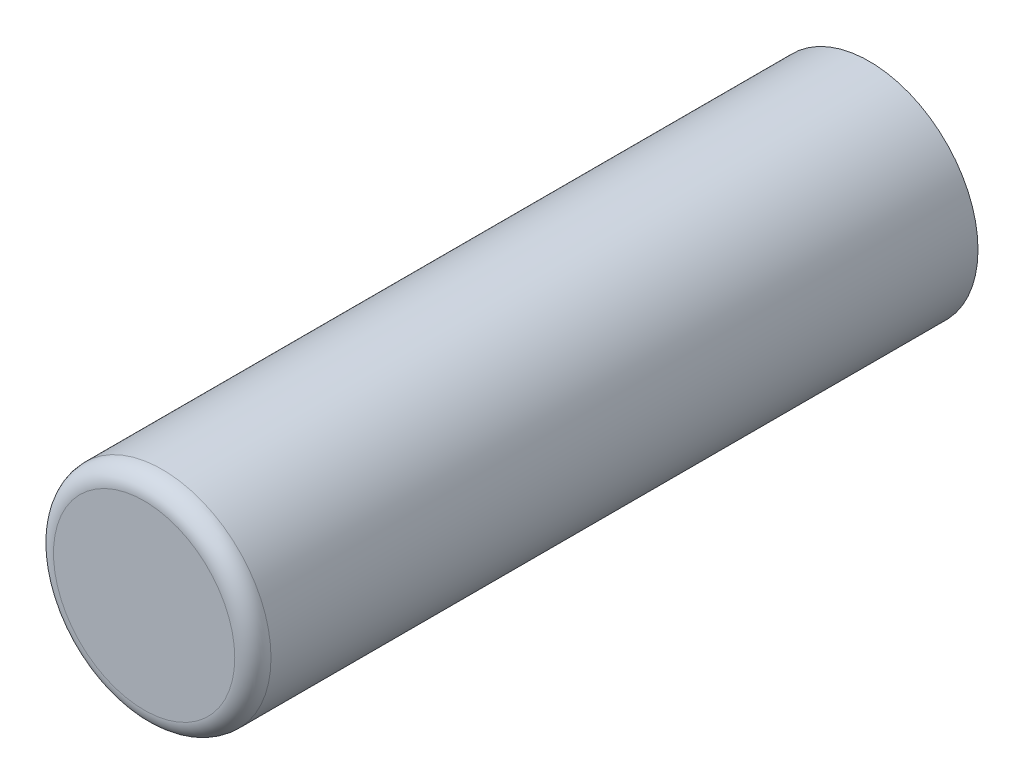
ISO-10303-21;
HEADER;
FILE_DESCRIPTION(('STEP AP214'),'2;1');
FILE_NAME('part.step','',(''),(''),'','','');
FILE_SCHEMA(('AUTOMOTIVE_DESIGN { 1 0 10303 214 1 1 1 1 }'));
ENDSEC;
DATA;
#1=APPLICATION_CONTEXT('core data for automotive mechanical design processes');
#2=APPLICATION_PROTOCOL_DEFINITION('international standard','automotive_design',2000,#1);
#3=PRODUCT_CONTEXT('',#1,'mechanical');
#4=PRODUCT('Part','Part','',(#3));
#5=PRODUCT_RELATED_PRODUCT_CATEGORY('part','',(#4));
#6=PRODUCT_DEFINITION_FORMATION('','',#4);
#7=PRODUCT_DEFINITION_CONTEXT('part definition',#1,'design');
#8=PRODUCT_DEFINITION('design','',#6,#7);
#9=PRODUCT_DEFINITION_SHAPE('','',#8);
#10=(LENGTH_UNIT() NAMED_UNIT(*) SI_UNIT(.MILLI.,.METRE.));
#11=(NAMED_UNIT(*) PLANE_ANGLE_UNIT() SI_UNIT($,.RADIAN.));
#12=(NAMED_UNIT(*) SI_UNIT($,.STERADIAN.) SOLID_ANGLE_UNIT());
#13=UNCERTAINTY_MEASURE_WITH_UNIT(LENGTH_MEASURE(1.E-05),#10,'distance_accuracy_value','');
#14=(GEOMETRIC_REPRESENTATION_CONTEXT(3) GLOBAL_UNCERTAINTY_ASSIGNED_CONTEXT((#13)) GLOBAL_UNIT_ASSIGNED_CONTEXT((#10,
#11,#12)) REPRESENTATION_CONTEXT('',''));
#15=CARTESIAN_POINT('',(0.,0.,0.));
#16=DIRECTION('',(0.,0.,1.));
#17=DIRECTION('',(1.,0.,0.));
#18=AXIS2_PLACEMENT_3D('',#15,#16,#17);
#19=CARTESIAN_POINT('',(0.,0.,16.));
#20=DIRECTION('',(0.,0.,-1.));
#21=DIRECTION('',(-1.,0.,0.));
#22=AXIS2_PLACEMENT_3D('',#19,#20,#21);
#23=CYLINDRICAL_SURFACE('',#22,4.8);
#24=CARTESIAN_POINT('',(0.,0.,15.2));
#25=DIRECTION('',(0.,0.,1.));
#26=DIRECTION('',(1.,0.,0.));
#27=AXIS2_PLACEMENT_3D('',#24,#25,#26);
#28=CIRCLE('',#27,4.8);
#29=CARTESIAN_POINT('',(4.8,0.,15.2));
#30=VERTEX_POINT('',#29);
#31=EDGE_CURVE('E10',#30,#30,#28,.F.);
#32=ORIENTED_EDGE('',*,*,#31,.T.);
#33=EDGE_LOOP('',(#32));
#34=FACE_BOUND('',#33,.T.);
#35=CARTESIAN_POINT('',(0.,0.,-16.));
#36=DIRECTION('',(0.,0.,1.));
#37=DIRECTION('',(1.,0.,0.));
#38=AXIS2_PLACEMENT_3D('',#35,#36,#37);
#39=CIRCLE('',#38,4.8);
#40=CARTESIAN_POINT('',(4.8,0.,-16.));
#41=VERTEX_POINT('',#40);
#42=EDGE_CURVE('E56',#41,#41,#39,.T.);
#43=ORIENTED_EDGE('',*,*,#42,.T.);
#44=EDGE_LOOP('',(#43));
#45=FACE_BOUND('',#44,.T.);
#46=ADVANCED_FACE('F41',(#34,#45),#23,.T.);
#47=CARTESIAN_POINT('',(0.,0.,16.));
#48=DIRECTION('',(0.,0.,1.));
#49=DIRECTION('',(1.,0.,0.));
#50=AXIS2_PLACEMENT_3D('',#47,#48,#49);
#51=PLANE('',#50);
#52=CARTESIAN_POINT('',(0.,0.,16.));
#53=DIRECTION('',(0.,0.,1.));
#54=DIRECTION('',(1.,0.,0.));
#55=AXIS2_PLACEMENT_3D('',#52,#53,#54);
#56=CIRCLE('',#55,4.);
#57=CARTESIAN_POINT('',(4.,0.,16.));
#58=VERTEX_POINT('',#57);
#59=EDGE_CURVE('E49',#58,#58,#56,.T.);
#60=ORIENTED_EDGE('',*,*,#59,.T.);
#61=EDGE_LOOP('',(#60));
#62=FACE_BOUND('',#61,.T.);
#63=ADVANCED_FACE('F71',(#62),#51,.T.);
#64=CARTESIAN_POINT('',(0.,0.,-16.));
#65=DIRECTION('',(0.,0.,1.));
#66=DIRECTION('',(1.,0.,0.));
#67=AXIS2_PLACEMENT_3D('',#64,#65,#66);
#68=PLANE('',#67);
#69=ORIENTED_EDGE('',*,*,#42,.F.);
#70=EDGE_LOOP('',(#69));
#71=FACE_BOUND('',#70,.T.);
#72=ADVANCED_FACE('F69',(#71),#68,.F.);
#73=CARTESIAN_POINT('',(0.,0.,15.2));
#74=DIRECTION('',(0.,0.,1.));
#75=DIRECTION('',(1.,0.,0.));
#76=AXIS2_PLACEMENT_3D('',#73,#74,#75);
#77=TOROIDAL_SURFACE('',#76,4.,0.8);
#78=ORIENTED_EDGE('',*,*,#31,.F.);
#79=EDGE_LOOP('',(#78));
#80=FACE_BOUND('',#79,.T.);
#81=ORIENTED_EDGE('',*,*,#59,.F.);
#82=EDGE_LOOP('',(#81));
#83=FACE_BOUND('',#82,.T.);
#84=ADVANCED_FACE('F43',(#80,#83),#77,.T.);
#85=CLOSED_SHELL('',(#46,#63,#72,#84));
#86=MANIFOLD_SOLID_BREP('B2',#85);
#87=ADVANCED_BREP_SHAPE_REPRESENTATION('',(#18,#86),#14);
#88=SHAPE_DEFINITION_REPRESENTATION(#9,#87);
ENDSEC;
END-ISO-10303-21;
